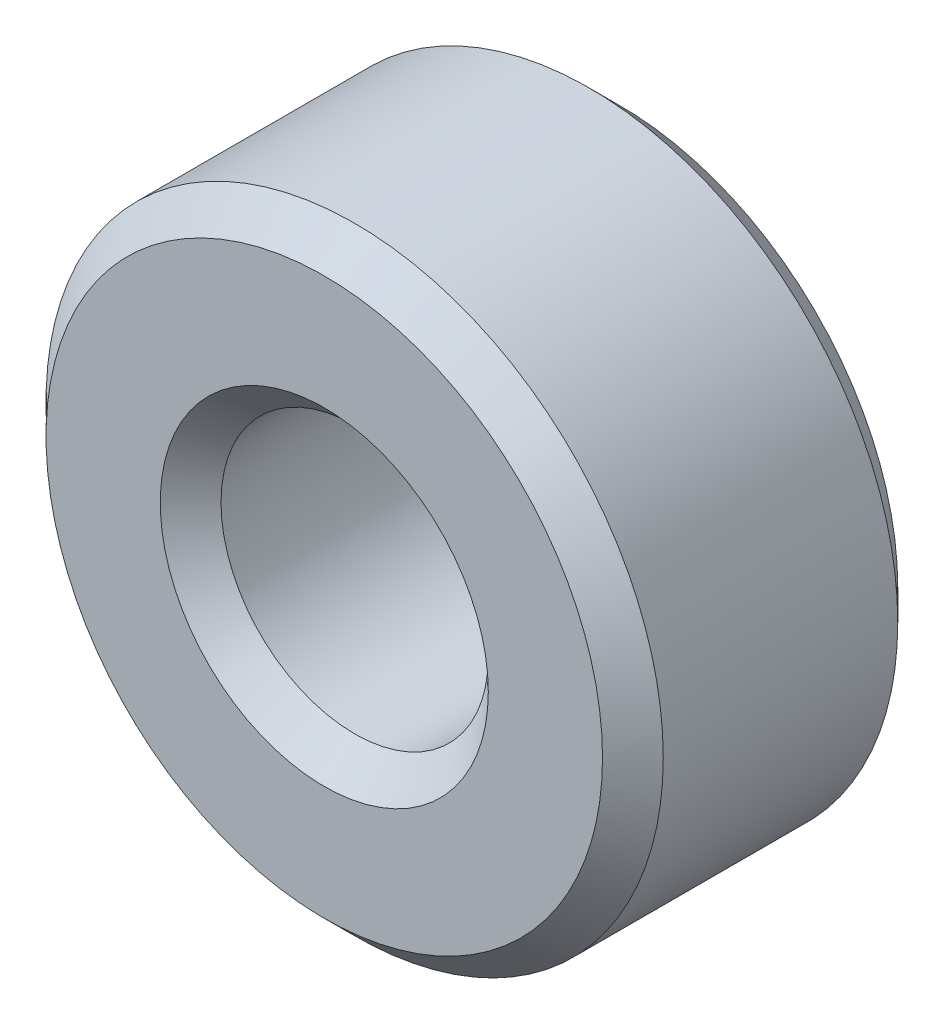
ISO-10303-21;
HEADER;
FILE_DESCRIPTION(('STEP AP214'),'2;1');
FILE_NAME('part.step','',(''),(''),'','','');
FILE_SCHEMA(('AUTOMOTIVE_DESIGN { 1 0 10303 214 1 1 1 1 }'));
ENDSEC;
DATA;
#1=APPLICATION_CONTEXT('core data for automotive mechanical design processes');
#2=APPLICATION_PROTOCOL_DEFINITION('international standard','automotive_design',2000,#1);
#3=PRODUCT_CONTEXT('',#1,'mechanical');
#4=PRODUCT('Part','Part','',(#3));
#5=PRODUCT_RELATED_PRODUCT_CATEGORY('part','',(#4));
#6=PRODUCT_DEFINITION_FORMATION('','',#4);
#7=PRODUCT_DEFINITION_CONTEXT('part definition',#1,'design');
#8=PRODUCT_DEFINITION('design','',#6,#7);
#9=PRODUCT_DEFINITION_SHAPE('','',#8);
#10=(LENGTH_UNIT() NAMED_UNIT(*) SI_UNIT(.MILLI.,.METRE.));
#11=(NAMED_UNIT(*) PLANE_ANGLE_UNIT() SI_UNIT($,.RADIAN.));
#12=(NAMED_UNIT(*) SI_UNIT($,.STERADIAN.) SOLID_ANGLE_UNIT());
#13=UNCERTAINTY_MEASURE_WITH_UNIT(LENGTH_MEASURE(1.E-05),#10,'distance_accuracy_value','');
#14=(GEOMETRIC_REPRESENTATION_CONTEXT(3) GLOBAL_UNCERTAINTY_ASSIGNED_CONTEXT((#13)) GLOBAL_UNIT_ASSIGNED_CONTEXT((#10,
#11,#12)) REPRESENTATION_CONTEXT('',''));
#15=CARTESIAN_POINT('',(0.,0.,0.));
#16=DIRECTION('',(0.,0.,1.));
#17=DIRECTION('',(1.,0.,0.));
#18=AXIS2_PLACEMENT_3D('',#15,#16,#17);
#19=CARTESIAN_POINT('',(0.,0.,24.3));
#20=DIRECTION('',(0.,0.,1.));
#21=DIRECTION('',(1.,0.,0.));
#22=AXIS2_PLACEMENT_3D('',#19,#20,#21);
#23=PLANE('',#22);
#24=CARTESIAN_POINT('',(0.,0.,24.3));
#25=DIRECTION('',(0.,0.,1.));
#26=DIRECTION('',(1.,0.,0.));
#27=AXIS2_PLACEMENT_3D('',#24,#25,#26);
#28=CIRCLE('',#27,13.5);
#29=CARTESIAN_POINT('',(13.5,0.,24.3));
#30=VERTEX_POINT('',#29);
#31=EDGE_CURVE('E42',#30,#30,#28,.F.);
#32=ORIENTED_EDGE('',*,*,#31,.T.);
#33=EDGE_LOOP('',(#32));
#34=FACE_BOUND('',#33,.T.);
#35=CARTESIAN_POINT('',(0.,0.,24.3));
#36=DIRECTION('',(0.,0.,1.));
#37=DIRECTION('',(1.,0.,0.));
#38=AXIS2_PLACEMENT_3D('',#35,#36,#37);
#39=CIRCLE('',#38,22.9);
#40=CARTESIAN_POINT('',(22.9,0.,24.3));
#41=VERTEX_POINT('',#40);
#42=EDGE_CURVE('E46',#41,#41,#39,.T.);
#43=ORIENTED_EDGE('',*,*,#42,.T.);
#44=EDGE_LOOP('',(#43));
#45=FACE_BOUND('',#44,.T.);
#46=ADVANCED_FACE('F31',(#34,#45),#23,.T.);
#47=CARTESIAN_POINT('',(0.,0.,0.));
#48=DIRECTION('',(0.,0.,1.));
#49=DIRECTION('',(1.,0.,0.));
#50=AXIS2_PLACEMENT_3D('',#47,#48,#49);
#51=PLANE('',#50);
#52=CARTESIAN_POINT('',(0.,0.,0.));
#53=DIRECTION('',(0.,0.,1.));
#54=DIRECTION('',(1.,0.,0.));
#55=AXIS2_PLACEMENT_3D('',#52,#53,#54);
#56=CIRCLE('',#55,13.5);
#57=CARTESIAN_POINT('',(13.5,0.,0.));
#58=VERTEX_POINT('',#57);
#59=EDGE_CURVE('E57',#58,#58,#56,.T.);
#60=ORIENTED_EDGE('',*,*,#59,.T.);
#61=EDGE_LOOP('',(#60));
#62=FACE_BOUND('',#61,.T.);
#63=CARTESIAN_POINT('',(0.,0.,0.));
#64=DIRECTION('',(0.,0.,1.));
#65=DIRECTION('',(1.,0.,0.));
#66=AXIS2_PLACEMENT_3D('',#63,#64,#65);
#67=CIRCLE('',#66,22.9);
#68=CARTESIAN_POINT('',(22.9,0.,0.));
#69=VERTEX_POINT('',#68);
#70=EDGE_CURVE('E60',#69,#69,#67,.F.);
#71=ORIENTED_EDGE('',*,*,#70,.T.);
#72=EDGE_LOOP('',(#71));
#73=FACE_BOUND('',#72,.T.);
#74=ADVANCED_FACE('F64',(#62,#73),#51,.F.);
#75=CARTESIAN_POINT('',(0.,0.,24.3));
#76=DIRECTION('',(0.,0.,-1.));
#77=DIRECTION('',(-1.,0.,0.));
#78=AXIS2_PLACEMENT_3D('',#75,#76,#77);
#79=CYLINDRICAL_SURFACE('',#78,25.4);
#80=CARTESIAN_POINT('',(0.,0.,2.49999999999998));
#81=DIRECTION('',(0.,0.,1.));
#82=DIRECTION('',(1.,0.,0.));
#83=AXIS2_PLACEMENT_3D('',#80,#81,#82);
#84=CIRCLE('',#83,25.4);
#85=CARTESIAN_POINT('',(25.4,0.,2.49999999999998));
#86=VERTEX_POINT('',#85);
#87=EDGE_CURVE('E10',#86,#86,#84,.T.);
#88=ORIENTED_EDGE('',*,*,#87,.T.);
#89=EDGE_LOOP('',(#88));
#90=FACE_BOUND('',#89,.T.);
#91=CARTESIAN_POINT('',(0.,0.,21.8));
#92=DIRECTION('',(0.,0.,1.));
#93=DIRECTION('',(1.,0.,0.));
#94=AXIS2_PLACEMENT_3D('',#91,#92,#93);
#95=CIRCLE('',#94,25.4);
#96=CARTESIAN_POINT('',(25.4,0.,21.8));
#97=VERTEX_POINT('',#96);
#98=EDGE_CURVE('E38',#97,#97,#95,.F.);
#99=ORIENTED_EDGE('',*,*,#98,.T.);
#100=EDGE_LOOP('',(#99));
#101=FACE_BOUND('',#100,.T.);
#102=ADVANCED_FACE('F84',(#90,#101),#79,.T.);
#103=CARTESIAN_POINT('',(0.,0.,24.3));
#104=DIRECTION('',(0.,0.,-1.));
#105=DIRECTION('',(-1.,0.,0.));
#106=AXIS2_PLACEMENT_3D('',#103,#104,#105);
#107=CYLINDRICAL_SURFACE('',#106,11.);
#108=CARTESIAN_POINT('',(0.,0.,2.5));
#109=DIRECTION('',(0.,0.,1.));
#110=DIRECTION('',(1.,0.,0.));
#111=AXIS2_PLACEMENT_3D('',#108,#109,#110);
#112=CIRCLE('',#111,11.);
#113=CARTESIAN_POINT('',(11.,0.,2.5));
#114=VERTEX_POINT('',#113);
#115=EDGE_CURVE('E51',#114,#114,#112,.F.);
#116=ORIENTED_EDGE('',*,*,#115,.T.);
#117=EDGE_LOOP('',(#116));
#118=FACE_BOUND('',#117,.T.);
#119=CARTESIAN_POINT('',(0.,0.,21.8));
#120=DIRECTION('',(0.,0.,1.));
#121=DIRECTION('',(1.,0.,0.));
#122=AXIS2_PLACEMENT_3D('',#119,#120,#121);
#123=CIRCLE('',#122,11.);
#124=CARTESIAN_POINT('',(11.,0.,21.8));
#125=VERTEX_POINT('',#124);
#126=EDGE_CURVE('E54',#125,#125,#123,.T.);
#127=ORIENTED_EDGE('',*,*,#126,.T.);
#128=EDGE_LOOP('',(#127));
#129=FACE_BOUND('',#128,.T.);
#130=ADVANCED_FACE('F89',(#118,#129),#107,.F.);
#131=CARTESIAN_POINT('',(0.,0.,0.));
#132=DIRECTION('',(0.,0.,-1.));
#133=DIRECTION('',(-1.,0.,0.));
#134=AXIS2_PLACEMENT_3D('',#131,#132,#133);
#135=CONICAL_SURFACE('',#134,13.5,0.785398163397446);
#136=ORIENTED_EDGE('',*,*,#115,.F.);
#137=EDGE_LOOP('',(#136));
#138=FACE_BOUND('',#137,.T.);
#139=ORIENTED_EDGE('',*,*,#59,.F.);
#140=EDGE_LOOP('',(#139));
#141=FACE_BOUND('',#140,.T.);
#142=ADVANCED_FACE('F75',(#138,#141),#135,.F.);
#143=CARTESIAN_POINT('',(0.,0.,21.8));
#144=DIRECTION('',(0.,0.,1.));
#145=DIRECTION('',(1.,0.,0.));
#146=AXIS2_PLACEMENT_3D('',#143,#144,#145);
#147=CONICAL_SURFACE('',#146,11.,0.785398163397451);
#148=ORIENTED_EDGE('',*,*,#31,.F.);
#149=EDGE_LOOP('',(#148));
#150=FACE_BOUND('',#149,.T.);
#151=ORIENTED_EDGE('',*,*,#126,.F.);
#152=EDGE_LOOP('',(#151));
#153=FACE_BOUND('',#152,.T.);
#154=ADVANCED_FACE('F69',(#150,#153),#147,.F.);
#155=CARTESIAN_POINT('',(0.,0.,2.49999999999998));
#156=DIRECTION('',(0.,0.,1.));
#157=DIRECTION('',(1.,0.,0.));
#158=AXIS2_PLACEMENT_3D('',#155,#156,#157);
#159=CONICAL_SURFACE('',#158,25.4,0.78539816339745);
#160=ORIENTED_EDGE('',*,*,#70,.F.);
#161=EDGE_LOOP('',(#160));
#162=FACE_BOUND('',#161,.T.);
#163=ORIENTED_EDGE('',*,*,#87,.F.);
#164=EDGE_LOOP('',(#163));
#165=FACE_BOUND('',#164,.T.);
#166=ADVANCED_FACE('F66',(#162,#165),#159,.T.);
#167=CARTESIAN_POINT('',(0.,0.,24.3));
#168=DIRECTION('',(0.,0.,-1.));
#169=DIRECTION('',(-1.,0.,0.));
#170=AXIS2_PLACEMENT_3D('',#167,#168,#169);
#171=CONICAL_SURFACE('',#170,22.9,0.785398163397448);
#172=ORIENTED_EDGE('',*,*,#98,.F.);
#173=EDGE_LOOP('',(#172));
#174=FACE_BOUND('',#173,.T.);
#175=ORIENTED_EDGE('',*,*,#42,.F.);
#176=EDGE_LOOP('',(#175));
#177=FACE_BOUND('',#176,.T.);
#178=ADVANCED_FACE('F33',(#174,#177),#171,.T.);
#179=CLOSED_SHELL('',(#46,#74,#102,#130,#142,#154,#166,#178));
#180=MANIFOLD_SOLID_BREP('B2',#179);
#181=ADVANCED_BREP_SHAPE_REPRESENTATION('',(#18,#180),#14);
#182=SHAPE_DEFINITION_REPRESENTATION(#9,#181);
ENDSEC;
END-ISO-10303-21;
